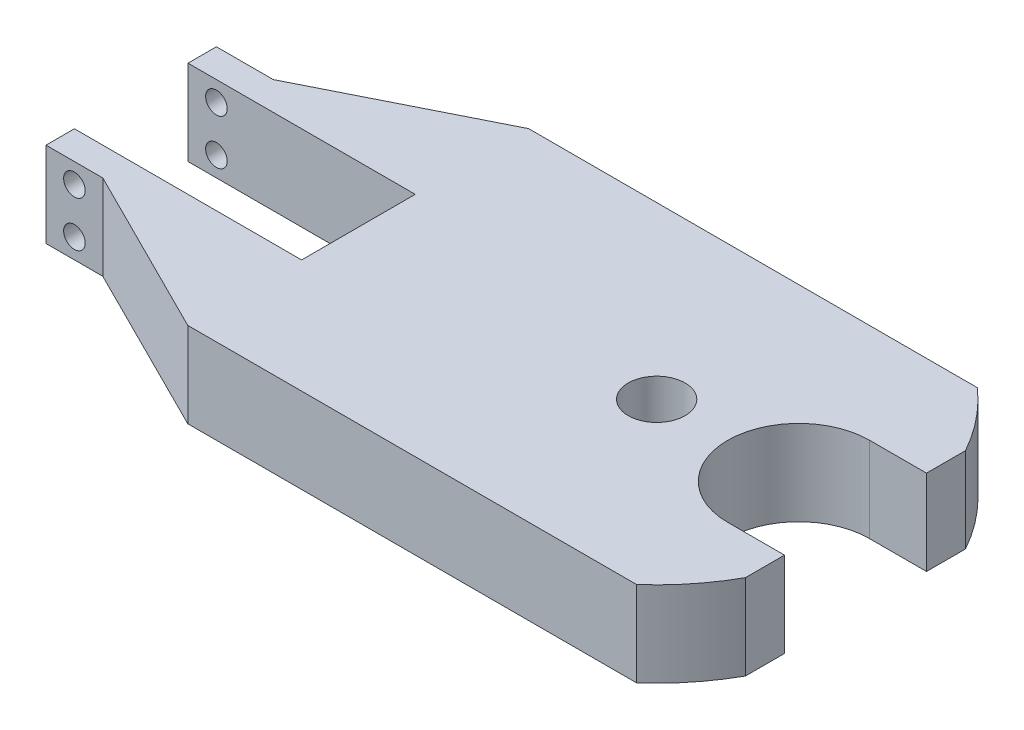
ISO-10303-21;
HEADER;
FILE_DESCRIPTION(('STEP AP214'),'2;1');
FILE_NAME('part.step','',(''),(''),'','','');
FILE_SCHEMA(('AUTOMOTIVE_DESIGN { 1 0 10303 214 1 1 1 1 }'));
ENDSEC;
DATA;
#1=APPLICATION_CONTEXT('core data for automotive mechanical design processes');
#2=APPLICATION_PROTOCOL_DEFINITION('international standard','automotive_design',2000,#1);
#3=PRODUCT_CONTEXT('',#1,'mechanical');
#4=PRODUCT('Part','Part','',(#3));
#5=PRODUCT_RELATED_PRODUCT_CATEGORY('part','',(#4));
#6=PRODUCT_DEFINITION_FORMATION('','',#4);
#7=PRODUCT_DEFINITION_CONTEXT('part definition',#1,'design');
#8=PRODUCT_DEFINITION('design','',#6,#7);
#9=PRODUCT_DEFINITION_SHAPE('','',#8);
#10=(LENGTH_UNIT() NAMED_UNIT(*) SI_UNIT(.MILLI.,.METRE.));
#11=(NAMED_UNIT(*) PLANE_ANGLE_UNIT() SI_UNIT($,.RADIAN.));
#12=(NAMED_UNIT(*) SI_UNIT($,.STERADIAN.) SOLID_ANGLE_UNIT());
#13=UNCERTAINTY_MEASURE_WITH_UNIT(LENGTH_MEASURE(1.E-05),#10,'distance_accuracy_value','');
#14=(GEOMETRIC_REPRESENTATION_CONTEXT(3) GLOBAL_UNCERTAINTY_ASSIGNED_CONTEXT((#13)) GLOBAL_UNIT_ASSIGNED_CONTEXT((#10,
#11,#12)) REPRESENTATION_CONTEXT('',''));
#15=CARTESIAN_POINT('',(0.,0.,0.));
#16=DIRECTION('',(0.,0.,1.));
#17=DIRECTION('',(1.,0.,0.));
#18=AXIS2_PLACEMENT_3D('',#15,#16,#17);
#19=CARTESIAN_POINT('',(5.25,0.75,0.));
#20=DIRECTION('',(0.,-1.,0.));
#21=DIRECTION('',(0.,0.,-1.));
#22=AXIS2_PLACEMENT_3D('',#19,#20,#21);
#23=PLANE('',#22);
#24=DIRECTION('',(0.,0.,1.));
#25=VECTOR('',#24,1.);
#26=CARTESIAN_POINT('',(0.,0.75,-1.));
#27=LINE('',#26,#25);
#28=CARTESIAN_POINT('',(0.,0.75,-1.));
#29=VERTEX_POINT('',#28);
#30=CARTESIAN_POINT('',(0.,0.75,1.));
#31=VERTEX_POINT('',#30);
#32=EDGE_CURVE('E260',#29,#31,#27,.T.);
#33=ORIENTED_EDGE('',*,*,#32,.T.);
#34=DIRECTION('',(-1.,0.,0.));
#35=VECTOR('',#34,1.);
#36=CARTESIAN_POINT('',(0.,0.75,1.));
#37=LINE('',#36,#35);
#38=CARTESIAN_POINT('',(-4.,0.75,1.));
#39=VERTEX_POINT('',#38);
#40=EDGE_CURVE('E136',#31,#39,#37,.T.);
#41=ORIENTED_EDGE('',*,*,#40,.T.);
#42=DIRECTION('',(0.,0.,1.));
#43=VECTOR('',#42,1.);
#44=CARTESIAN_POINT('',(-4.,0.75,1.));
#45=LINE('',#44,#43);
#46=CARTESIAN_POINT('',(-4.,0.75,1.5));
#47=VERTEX_POINT('',#46);
#48=EDGE_CURVE('E364',#39,#47,#45,.T.);
#49=ORIENTED_EDGE('',*,*,#48,.T.);
#50=DIRECTION('',(1.,0.,0.));
#51=VECTOR('',#50,1.);
#52=CARTESIAN_POINT('',(-4.,0.75,1.5));
#53=LINE('',#52,#51);
#54=CARTESIAN_POINT('',(-3.,0.75,1.5));
#55=VERTEX_POINT('',#54);
#56=EDGE_CURVE('E367',#47,#55,#53,.T.);
#57=ORIENTED_EDGE('',*,*,#56,.T.);
#58=DIRECTION('',(0.894153182134338,0.,0.447761194029851));
#59=VECTOR('',#58,1.);
#60=CARTESIAN_POINT('',(-3.,0.75,1.5));
#61=LINE('',#60,#59);
#62=CARTESIAN_POINT('',(-0.00458683984996822,0.75,3.));
#63=VERTEX_POINT('',#62);
#64=EDGE_CURVE('E370',#55,#63,#61,.T.);
#65=ORIENTED_EDGE('',*,*,#64,.T.);
#66=DIRECTION('',(1.,0.,0.));
#67=VECTOR('',#66,1.);
#68=CARTESIAN_POINT('',(-0.00458683984996822,0.75,3.));
#69=LINE('',#68,#67);
#70=CARTESIAN_POINT('',(7.89575131106459,0.75,3.));
#71=VERTEX_POINT('',#70);
#72=EDGE_CURVE('E373',#63,#71,#69,.T.);
#73=ORIENTED_EDGE('',*,*,#72,.T.);
#74=CARTESIAN_POINT('',(5.25,0.75,0.));
#75=DIRECTION('',(0.,1.,0.));
#76=DIRECTION('',(0.,0.,-1.));
#77=AXIS2_PLACEMENT_3D('',#74,#75,#76);
#78=CIRCLE('',#77,4.);
#79=CARTESIAN_POINT('',(8.75,0.75,1.93649167310371));
#80=VERTEX_POINT('',#79);
#81=EDGE_CURVE('E376',#71,#80,#78,.T.);
#82=ORIENTED_EDGE('',*,*,#81,.T.);
#83=DIRECTION('',(0.,0.,-1.));
#84=VECTOR('',#83,1.);
#85=CARTESIAN_POINT('',(8.75,0.75,1.93649167310371));
#86=LINE('',#85,#84);
#87=CARTESIAN_POINT('',(8.75,0.75,1.25));
#88=VERTEX_POINT('',#87);
#89=EDGE_CURVE('E379',#80,#88,#86,.T.);
#90=ORIENTED_EDGE('',*,*,#89,.T.);
#91=DIRECTION('',(-1.,0.,0.));
#92=VECTOR('',#91,1.);
#93=CARTESIAN_POINT('',(8.75,0.75,1.25));
#94=LINE('',#93,#92);
#95=CARTESIAN_POINT('',(7.75,0.75,1.25));
#96=VERTEX_POINT('',#95);
#97=EDGE_CURVE('E382',#88,#96,#94,.T.);
#98=ORIENTED_EDGE('',*,*,#97,.T.);
#99=CARTESIAN_POINT('',(7.75,0.75,0.));
#100=DIRECTION('',(0.,-1.,0.));
#101=DIRECTION('',(0.,0.,1.));
#102=AXIS2_PLACEMENT_3D('',#99,#100,#101);
#103=CIRCLE('',#102,1.25);
#104=CARTESIAN_POINT('',(7.75,0.75,-1.25));
#105=VERTEX_POINT('',#104);
#106=EDGE_CURVE('E385',#96,#105,#103,.T.);
#107=ORIENTED_EDGE('',*,*,#106,.T.);
#108=DIRECTION('',(1.,0.,0.));
#109=VECTOR('',#108,1.);
#110=CARTESIAN_POINT('',(8.75,0.75,-1.25));
#111=LINE('',#110,#109);
#112=CARTESIAN_POINT('',(8.75,0.75,-1.25));
#113=VERTEX_POINT('',#112);
#114=EDGE_CURVE('E388',#105,#113,#111,.T.);
#115=ORIENTED_EDGE('',*,*,#114,.T.);
#116=DIRECTION('',(0.,0.,-1.));
#117=VECTOR('',#116,1.);
#118=CARTESIAN_POINT('',(8.75,0.75,-1.93649167310371));
#119=LINE('',#118,#117);
#120=CARTESIAN_POINT('',(8.75,0.75,-1.93649167310371));
#121=VERTEX_POINT('',#120);
#122=EDGE_CURVE('E391',#113,#121,#119,.T.);
#123=ORIENTED_EDGE('',*,*,#122,.T.);
#124=CARTESIAN_POINT('',(5.25,0.75,0.));
#125=DIRECTION('',(0.,1.,0.));
#126=DIRECTION('',(0.,0.,1.));
#127=AXIS2_PLACEMENT_3D('',#124,#125,#126);
#128=CIRCLE('',#127,4.);
#129=CARTESIAN_POINT('',(7.89575131106459,0.75,-3.));
#130=VERTEX_POINT('',#129);
#131=EDGE_CURVE('E394',#121,#130,#128,.T.);
#132=ORIENTED_EDGE('',*,*,#131,.T.);
#133=DIRECTION('',(-1.,0.,0.));
#134=VECTOR('',#133,1.);
#135=CARTESIAN_POINT('',(-0.00458683984996822,0.75,-3.));
#136=LINE('',#135,#134);
#137=CARTESIAN_POINT('',(-0.00458683984996822,0.75,-3.));
#138=VERTEX_POINT('',#137);
#139=EDGE_CURVE('E397',#130,#138,#136,.T.);
#140=ORIENTED_EDGE('',*,*,#139,.T.);
#141=DIRECTION('',(-0.894153182134338,0.,0.447761194029851));
#142=VECTOR('',#141,1.);
#143=CARTESIAN_POINT('',(-3.,0.75,-1.5));
#144=LINE('',#143,#142);
#145=CARTESIAN_POINT('',(-3.,0.75,-1.5));
#146=VERTEX_POINT('',#145);
#147=EDGE_CURVE('E185',#138,#146,#144,.T.);
#148=ORIENTED_EDGE('',*,*,#147,.T.);
#149=DIRECTION('',(-1.,0.,0.));
#150=VECTOR('',#149,1.);
#151=CARTESIAN_POINT('',(-4.,0.75,-1.5));
#152=LINE('',#151,#150);
#153=CARTESIAN_POINT('',(-4.,0.75,-1.5));
#154=VERTEX_POINT('',#153);
#155=EDGE_CURVE('E179',#146,#154,#152,.T.);
#156=ORIENTED_EDGE('',*,*,#155,.T.);
#157=DIRECTION('',(0.,0.,1.));
#158=VECTOR('',#157,1.);
#159=CARTESIAN_POINT('',(-4.,0.75,-1.));
#160=LINE('',#159,#158);
#161=CARTESIAN_POINT('',(-4.,0.75,-1.));
#162=VERTEX_POINT('',#161);
#163=EDGE_CURVE('E183',#154,#162,#160,.T.);
#164=ORIENTED_EDGE('',*,*,#163,.T.);
#165=DIRECTION('',(1.,0.,0.));
#166=VECTOR('',#165,1.);
#167=CARTESIAN_POINT('',(0.,0.75,-1.));
#168=LINE('',#167,#166);
#169=EDGE_CURVE('E63',#162,#29,#168,.T.);
#170=ORIENTED_EDGE('',*,*,#169,.T.);
#171=EDGE_LOOP('',(#33,#41,#49,#57,#65,#73,#82,#90,#98,#107,#115,#123,#132,#140,#148,#156,#164,#170));
#172=FACE_BOUND('',#171,.T.);
#173=CARTESIAN_POINT('',(5.25,0.75,0.));
#174=DIRECTION('',(0.,1.,0.));
#175=DIRECTION('',(0.,0.,1.));
#176=AXIS2_PLACEMENT_3D('',#173,#174,#175);
#177=CIRCLE('',#176,0.500000000000001);
#178=CARTESIAN_POINT('',(5.25,0.75,0.500000000000001));
#179=VERTEX_POINT('',#178);
#180=EDGE_CURVE('E212',#179,#179,#177,.T.);
#181=ORIENTED_EDGE('',*,*,#180,.F.);
#182=EDGE_LOOP('',(#181));
#183=FACE_BOUND('',#182,.T.);
#184=ADVANCED_FACE('F43',(#172,#183),#23,.F.);
#185=CARTESIAN_POINT('',(5.25,-0.75,0.));
#186=DIRECTION('',(0.,-1.,0.));
#187=DIRECTION('',(0.,0.,-1.));
#188=AXIS2_PLACEMENT_3D('',#185,#186,#187);
#189=PLANE('',#188);
#190=DIRECTION('',(0.,0.,1.));
#191=VECTOR('',#190,1.);
#192=CARTESIAN_POINT('',(0.,-0.75,-1.));
#193=LINE('',#192,#191);
#194=CARTESIAN_POINT('',(0.,-0.75,-1.));
#195=VERTEX_POINT('',#194);
#196=CARTESIAN_POINT('',(0.,-0.75,1.));
#197=VERTEX_POINT('',#196);
#198=EDGE_CURVE('E207',#195,#197,#193,.T.);
#199=ORIENTED_EDGE('',*,*,#198,.F.);
#200=DIRECTION('',(1.,0.,0.));
#201=VECTOR('',#200,1.);
#202=CARTESIAN_POINT('',(0.,-0.75,-1.));
#203=LINE('',#202,#201);
#204=CARTESIAN_POINT('',(-4.,-0.75,-1.));
#205=VERTEX_POINT('',#204);
#206=EDGE_CURVE('E128',#205,#195,#203,.T.);
#207=ORIENTED_EDGE('',*,*,#206,.F.);
#208=DIRECTION('',(0.,0.,1.));
#209=VECTOR('',#208,1.);
#210=CARTESIAN_POINT('',(-4.,-0.75,-1.));
#211=LINE('',#210,#209);
#212=CARTESIAN_POINT('',(-4.,-0.75,-1.5));
#213=VERTEX_POINT('',#212);
#214=EDGE_CURVE('E122',#213,#205,#211,.T.);
#215=ORIENTED_EDGE('',*,*,#214,.F.);
#216=DIRECTION('',(-1.,0.,0.));
#217=VECTOR('',#216,1.);
#218=CARTESIAN_POINT('',(-4.,-0.75,-1.5));
#219=LINE('',#218,#217);
#220=CARTESIAN_POINT('',(-3.,-0.75,-1.5));
#221=VERTEX_POINT('',#220);
#222=EDGE_CURVE('E194',#221,#213,#219,.T.);
#223=ORIENTED_EDGE('',*,*,#222,.F.);
#224=DIRECTION('',(-0.894153182134338,0.,0.447761194029851));
#225=VECTOR('',#224,1.);
#226=CARTESIAN_POINT('',(-3.,-0.75,-1.5));
#227=LINE('',#226,#225);
#228=CARTESIAN_POINT('',(-0.00458683984996822,-0.75,-3.));
#229=VERTEX_POINT('',#228);
#230=EDGE_CURVE('E251',#229,#221,#227,.T.);
#231=ORIENTED_EDGE('',*,*,#230,.F.);
#232=DIRECTION('',(-1.,0.,0.));
#233=VECTOR('',#232,1.);
#234=CARTESIAN_POINT('',(-0.00458683984996822,-0.75,-3.));
#235=LINE('',#234,#233);
#236=CARTESIAN_POINT('',(7.89575131106459,-0.75,-3.));
#237=VERTEX_POINT('',#236);
#238=EDGE_CURVE('E248',#237,#229,#235,.T.);
#239=ORIENTED_EDGE('',*,*,#238,.F.);
#240=CARTESIAN_POINT('',(5.25,-0.75,0.));
#241=DIRECTION('',(0.,1.,0.));
#242=DIRECTION('',(0.,0.,1.));
#243=AXIS2_PLACEMENT_3D('',#240,#241,#242);
#244=CIRCLE('',#243,4.);
#245=CARTESIAN_POINT('',(8.75,-0.75,-1.93649167310371));
#246=VERTEX_POINT('',#245);
#247=EDGE_CURVE('E245',#246,#237,#244,.T.);
#248=ORIENTED_EDGE('',*,*,#247,.F.);
#249=DIRECTION('',(0.,0.,-1.));
#250=VECTOR('',#249,1.);
#251=CARTESIAN_POINT('',(8.75,-0.75,-1.93649167310371));
#252=LINE('',#251,#250);
#253=CARTESIAN_POINT('',(8.75,-0.75,-1.25));
#254=VERTEX_POINT('',#253);
#255=EDGE_CURVE('E242',#254,#246,#252,.T.);
#256=ORIENTED_EDGE('',*,*,#255,.F.);
#257=DIRECTION('',(1.,0.,0.));
#258=VECTOR('',#257,1.);
#259=CARTESIAN_POINT('',(8.75,-0.75,-1.25));
#260=LINE('',#259,#258);
#261=CARTESIAN_POINT('',(7.75,-0.75,-1.25));
#262=VERTEX_POINT('',#261);
#263=EDGE_CURVE('E239',#262,#254,#260,.T.);
#264=ORIENTED_EDGE('',*,*,#263,.F.);
#265=CARTESIAN_POINT('',(7.75,-0.75,0.));
#266=DIRECTION('',(0.,-1.,0.));
#267=DIRECTION('',(0.,0.,1.));
#268=AXIS2_PLACEMENT_3D('',#265,#266,#267);
#269=CIRCLE('',#268,1.25);
#270=CARTESIAN_POINT('',(7.75,-0.75,1.25));
#271=VERTEX_POINT('',#270);
#272=EDGE_CURVE('E236',#271,#262,#269,.T.);
#273=ORIENTED_EDGE('',*,*,#272,.F.);
#274=DIRECTION('',(-1.,0.,0.));
#275=VECTOR('',#274,1.);
#276=CARTESIAN_POINT('',(8.75,-0.75,1.25));
#277=LINE('',#276,#275);
#278=CARTESIAN_POINT('',(8.75,-0.75,1.25));
#279=VERTEX_POINT('',#278);
#280=EDGE_CURVE('E233',#279,#271,#277,.T.);
#281=ORIENTED_EDGE('',*,*,#280,.F.);
#282=DIRECTION('',(0.,0.,-1.));
#283=VECTOR('',#282,1.);
#284=CARTESIAN_POINT('',(8.75,-0.75,1.93649167310371));
#285=LINE('',#284,#283);
#286=CARTESIAN_POINT('',(8.75,-0.75,1.93649167310371));
#287=VERTEX_POINT('',#286);
#288=EDGE_CURVE('E230',#287,#279,#285,.T.);
#289=ORIENTED_EDGE('',*,*,#288,.F.);
#290=CARTESIAN_POINT('',(5.25,-0.75,0.));
#291=DIRECTION('',(0.,1.,0.));
#292=DIRECTION('',(0.,0.,-1.));
#293=AXIS2_PLACEMENT_3D('',#290,#291,#292);
#294=CIRCLE('',#293,4.);
#295=CARTESIAN_POINT('',(7.89575131106459,-0.75,3.));
#296=VERTEX_POINT('',#295);
#297=EDGE_CURVE('E227',#296,#287,#294,.T.);
#298=ORIENTED_EDGE('',*,*,#297,.F.);
#299=DIRECTION('',(1.,0.,0.));
#300=VECTOR('',#299,1.);
#301=CARTESIAN_POINT('',(-0.00458683984996822,-0.75,3.));
#302=LINE('',#301,#300);
#303=CARTESIAN_POINT('',(-0.00458683984996822,-0.75,3.));
#304=VERTEX_POINT('',#303);
#305=EDGE_CURVE('E224',#304,#296,#302,.T.);
#306=ORIENTED_EDGE('',*,*,#305,.F.);
#307=DIRECTION('',(0.894153182134338,0.,0.447761194029851));
#308=VECTOR('',#307,1.);
#309=CARTESIAN_POINT('',(-3.,-0.75,1.5));
#310=LINE('',#309,#308);
#311=CARTESIAN_POINT('',(-3.,-0.75,1.5));
#312=VERTEX_POINT('',#311);
#313=EDGE_CURVE('E221',#312,#304,#310,.T.);
#314=ORIENTED_EDGE('',*,*,#313,.F.);
#315=DIRECTION('',(1.,0.,0.));
#316=VECTOR('',#315,1.);
#317=CARTESIAN_POINT('',(-4.,-0.75,1.5));
#318=LINE('',#317,#316);
#319=CARTESIAN_POINT('',(-4.,-0.75,1.5));
#320=VERTEX_POINT('',#319);
#321=EDGE_CURVE('E218',#320,#312,#318,.T.);
#322=ORIENTED_EDGE('',*,*,#321,.F.);
#323=DIRECTION('',(0.,0.,1.));
#324=VECTOR('',#323,1.);
#325=CARTESIAN_POINT('',(-4.,-0.75,1.));
#326=LINE('',#325,#324);
#327=CARTESIAN_POINT('',(-4.,-0.75,1.));
#328=VERTEX_POINT('',#327);
#329=EDGE_CURVE('E215',#328,#320,#326,.T.);
#330=ORIENTED_EDGE('',*,*,#329,.F.);
#331=DIRECTION('',(-1.,0.,0.));
#332=VECTOR('',#331,1.);
#333=CARTESIAN_POINT('',(0.,-0.75,1.));
#334=LINE('',#333,#332);
#335=EDGE_CURVE('E211',#197,#328,#334,.T.);
#336=ORIENTED_EDGE('',*,*,#335,.F.);
#337=EDGE_LOOP('',(#199,#207,#215,#223,#231,#239,#248,#256,#264,#273,#281,#289,#298,#306,#314,
#322,#330,#336));
#338=FACE_BOUND('',#337,.T.);
#339=CARTESIAN_POINT('',(5.25,-0.75,0.));
#340=DIRECTION('',(0.,1.,0.));
#341=DIRECTION('',(0.,0.,1.));
#342=AXIS2_PLACEMENT_3D('',#339,#340,#341);
#343=CIRCLE('',#342,0.500000000000001);
#344=CARTESIAN_POINT('',(5.25,-0.75,0.500000000000001));
#345=VERTEX_POINT('',#344);
#346=EDGE_CURVE('E353',#345,#345,#343,.T.);
#347=ORIENTED_EDGE('',*,*,#346,.T.);
#348=EDGE_LOOP('',(#347));
#349=FACE_BOUND('',#348,.T.);
#350=ADVANCED_FACE('F433',(#338,#349),#189,.T.);
#351=CARTESIAN_POINT('',(0.,0.75,-1.));
#352=DIRECTION('',(1.,0.,0.));
#353=DIRECTION('',(0.,0.,-1.));
#354=AXIS2_PLACEMENT_3D('',#351,#352,#353);
#355=PLANE('',#354);
#356=CARTESIAN_POINT('',(0.,0.,0.));
#357=DIRECTION('',(-1.,0.,0.));
#358=DIRECTION('',(0.,0.,1.));
#359=AXIS2_PLACEMENT_3D('',#356,#357,#358);
#360=CIRCLE('',#359,0.375);
#361=CARTESIAN_POINT('',(0.,0.,0.375));
#362=VERTEX_POINT('',#361);
#363=EDGE_CURVE('E339',#362,#362,#360,.T.);
#364=ORIENTED_EDGE('',*,*,#363,.F.);
#365=EDGE_LOOP('',(#364));
#366=FACE_BOUND('',#365,.T.);
#367=ORIENTED_EDGE('',*,*,#198,.T.);
#368=DIRECTION('',(0.,-1.,0.));
#369=VECTOR('',#368,1.);
#370=CARTESIAN_POINT('',(0.,0.75,1.));
#371=LINE('',#370,#369);
#372=EDGE_CURVE('E11',#31,#197,#371,.T.);
#373=ORIENTED_EDGE('',*,*,#372,.F.);
#374=ORIENTED_EDGE('',*,*,#32,.F.);
#375=DIRECTION('',(0.,-1.,0.));
#376=VECTOR('',#375,1.);
#377=CARTESIAN_POINT('',(0.,0.75,-1.));
#378=LINE('',#377,#376);
#379=EDGE_CURVE('E203',#29,#195,#378,.T.);
#380=ORIENTED_EDGE('',*,*,#379,.T.);
#381=EDGE_LOOP('',(#367,#373,#374,#380));
#382=FACE_BOUND('',#381,.T.);
#383=ADVANCED_FACE('F45',(#366,#382),#355,.F.);
#384=CARTESIAN_POINT('',(0.,0.75,1.));
#385=DIRECTION('',(0.,0.,1.));
#386=DIRECTION('',(1.,0.,0.));
#387=AXIS2_PLACEMENT_3D('',#384,#385,#386);
#388=PLANE('',#387);
#389=CARTESIAN_POINT('',(-3.5,0.4,1.));
#390=DIRECTION('',(0.,0.,1.));
#391=DIRECTION('',(1.,0.,0.));
#392=AXIS2_PLACEMENT_3D('',#389,#390,#391);
#393=CIRCLE('',#392,0.19);
#394=CARTESIAN_POINT('',(-3.31,0.4,1.));
#395=VERTEX_POINT('',#394);
#396=EDGE_CURVE('E349',#395,#395,#393,.T.);
#397=ORIENTED_EDGE('',*,*,#396,.T.);
#398=EDGE_LOOP('',(#397));
#399=FACE_BOUND('',#398,.T.);
#400=CARTESIAN_POINT('',(-3.5,-0.4,1.));
#401=DIRECTION('',(0.,0.,1.));
#402=DIRECTION('',(1.,0.,0.));
#403=AXIS2_PLACEMENT_3D('',#400,#401,#402);
#404=CIRCLE('',#403,0.19);
#405=CARTESIAN_POINT('',(-3.31,-0.4,1.));
#406=VERTEX_POINT('',#405);
#407=EDGE_CURVE('E327',#406,#406,#404,.T.);
#408=ORIENTED_EDGE('',*,*,#407,.T.);
#409=EDGE_LOOP('',(#408));
#410=FACE_BOUND('',#409,.T.);
#411=ORIENTED_EDGE('',*,*,#335,.T.);
#412=DIRECTION('',(0.,-1.,0.));
#413=VECTOR('',#412,1.);
#414=CARTESIAN_POINT('',(-4.,0.75,1.));
#415=LINE('',#414,#413);
#416=EDGE_CURVE('E54',#39,#328,#415,.T.);
#417=ORIENTED_EDGE('',*,*,#416,.F.);
#418=ORIENTED_EDGE('',*,*,#40,.F.);
#419=ORIENTED_EDGE('',*,*,#372,.T.);
#420=EDGE_LOOP('',(#411,#417,#418,#419));
#421=FACE_BOUND('',#420,.T.);
#422=ADVANCED_FACE('F494',(#399,#410,#421),#388,.F.);
#423=CARTESIAN_POINT('',(-4.,0.75,1.));
#424=DIRECTION('',(1.,0.,0.));
#425=DIRECTION('',(0.,0.,-1.));
#426=AXIS2_PLACEMENT_3D('',#423,#424,#425);
#427=PLANE('',#426);
#428=ORIENTED_EDGE('',*,*,#329,.T.);
#429=DIRECTION('',(0.,-1.,0.));
#430=VECTOR('',#429,1.);
#431=CARTESIAN_POINT('',(-4.,0.75,1.5));
#432=LINE('',#431,#430);
#433=EDGE_CURVE('E311',#47,#320,#432,.T.);
#434=ORIENTED_EDGE('',*,*,#433,.F.);
#435=ORIENTED_EDGE('',*,*,#48,.F.);
#436=ORIENTED_EDGE('',*,*,#416,.T.);
#437=EDGE_LOOP('',(#428,#434,#435,#436));
#438=FACE_BOUND('',#437,.T.);
#439=ADVANCED_FACE('F491',(#438),#427,.F.);
#440=CARTESIAN_POINT('',(-4.,0.75,1.5));
#441=DIRECTION('',(0.,0.,-1.));
#442=DIRECTION('',(-1.,0.,0.));
#443=AXIS2_PLACEMENT_3D('',#440,#441,#442);
#444=PLANE('',#443);
#445=CARTESIAN_POINT('',(-3.5,0.4,1.5));
#446=DIRECTION('',(0.,0.,1.));
#447=DIRECTION('',(1.,0.,0.));
#448=AXIS2_PLACEMENT_3D('',#445,#446,#447);
#449=CIRCLE('',#448,0.19);
#450=CARTESIAN_POINT('',(-3.31,0.4,1.5));
#451=VERTEX_POINT('',#450);
#452=EDGE_CURVE('E321',#451,#451,#449,.T.);
#453=ORIENTED_EDGE('',*,*,#452,.F.);
#454=EDGE_LOOP('',(#453));
#455=FACE_BOUND('',#454,.T.);
#456=CARTESIAN_POINT('',(-3.5,-0.4,1.5));
#457=DIRECTION('',(0.,0.,1.));
#458=DIRECTION('',(1.,0.,0.));
#459=AXIS2_PLACEMENT_3D('',#456,#457,#458);
#460=CIRCLE('',#459,0.19);
#461=CARTESIAN_POINT('',(-3.31,-0.4,1.5));
#462=VERTEX_POINT('',#461);
#463=EDGE_CURVE('E330',#462,#462,#460,.T.);
#464=ORIENTED_EDGE('',*,*,#463,.F.);
#465=EDGE_LOOP('',(#464));
#466=FACE_BOUND('',#465,.T.);
#467=ORIENTED_EDGE('',*,*,#321,.T.);
#468=DIRECTION('',(0.,-1.,0.));
#469=VECTOR('',#468,1.);
#470=CARTESIAN_POINT('',(-3.,0.75,1.5));
#471=LINE('',#470,#469);
#472=EDGE_CURVE('E307',#55,#312,#471,.T.);
#473=ORIENTED_EDGE('',*,*,#472,.F.);
#474=ORIENTED_EDGE('',*,*,#56,.F.);
#475=ORIENTED_EDGE('',*,*,#433,.T.);
#476=EDGE_LOOP('',(#467,#473,#474,#475));
#477=FACE_BOUND('',#476,.T.);
#478=ADVANCED_FACE('F487',(#455,#466,#477),#444,.F.);
#479=CARTESIAN_POINT('',(-3.,0.75,1.5));
#480=DIRECTION('',(0.447761194029851,0.,-0.894153182134338));
#481=DIRECTION('',(-0.894153182134338,0.,-0.447761194029851));
#482=AXIS2_PLACEMENT_3D('',#479,#480,#481);
#483=PLANE('',#482);
#484=ORIENTED_EDGE('',*,*,#313,.T.);
#485=DIRECTION('',(0.,-1.,0.));
#486=VECTOR('',#485,1.);
#487=CARTESIAN_POINT('',(-0.00458683984996822,0.75,3.));
#488=LINE('',#487,#486);
#489=EDGE_CURVE('E303',#63,#304,#488,.T.);
#490=ORIENTED_EDGE('',*,*,#489,.F.);
#491=ORIENTED_EDGE('',*,*,#64,.F.);
#492=ORIENTED_EDGE('',*,*,#472,.T.);
#493=EDGE_LOOP('',(#484,#490,#491,#492));
#494=FACE_BOUND('',#493,.T.);
#495=ADVANCED_FACE('F483',(#494),#483,.F.);
#496=CARTESIAN_POINT('',(-0.00458683984996822,0.75,3.));
#497=DIRECTION('',(0.,0.,-1.));
#498=DIRECTION('',(-1.,0.,0.));
#499=AXIS2_PLACEMENT_3D('',#496,#497,#498);
#500=PLANE('',#499);
#501=ORIENTED_EDGE('',*,*,#305,.T.);
#502=DIRECTION('',(0.,-1.,0.));
#503=VECTOR('',#502,1.);
#504=CARTESIAN_POINT('',(7.89575131106459,0.75,3.));
#505=LINE('',#504,#503);
#506=EDGE_CURVE('E299',#71,#296,#505,.T.);
#507=ORIENTED_EDGE('',*,*,#506,.F.);
#508=ORIENTED_EDGE('',*,*,#72,.F.);
#509=ORIENTED_EDGE('',*,*,#489,.T.);
#510=EDGE_LOOP('',(#501,#507,#508,#509));
#511=FACE_BOUND('',#510,.T.);
#512=ADVANCED_FACE('F479',(#511),#500,.F.);
#513=CARTESIAN_POINT('',(5.25,0.75,0.));
#514=DIRECTION('',(0.,-1.,0.));
#515=DIRECTION('',(0.,0.,-1.));
#516=AXIS2_PLACEMENT_3D('',#513,#514,#515);
#517=CYLINDRICAL_SURFACE('',#516,4.);
#518=ORIENTED_EDGE('',*,*,#297,.T.);
#519=DIRECTION('',(0.,-1.,0.));
#520=VECTOR('',#519,1.);
#521=CARTESIAN_POINT('',(8.75,0.75,1.93649167310371));
#522=LINE('',#521,#520);
#523=EDGE_CURVE('E295',#80,#287,#522,.T.);
#524=ORIENTED_EDGE('',*,*,#523,.F.);
#525=ORIENTED_EDGE('',*,*,#81,.F.);
#526=ORIENTED_EDGE('',*,*,#506,.T.);
#527=EDGE_LOOP('',(#518,#524,#525,#526));
#528=FACE_BOUND('',#527,.T.);
#529=ADVANCED_FACE('F475',(#528),#517,.T.);
#530=CARTESIAN_POINT('',(8.75,0.75,1.93649167310371));
#531=DIRECTION('',(-1.,0.,0.));
#532=DIRECTION('',(0.,0.,1.));
#533=AXIS2_PLACEMENT_3D('',#530,#531,#532);
#534=PLANE('',#533);
#535=ORIENTED_EDGE('',*,*,#288,.T.);
#536=DIRECTION('',(0.,-1.,0.));
#537=VECTOR('',#536,1.);
#538=CARTESIAN_POINT('',(8.75,0.75,1.25));
#539=LINE('',#538,#537);
#540=EDGE_CURVE('E291',#88,#279,#539,.T.);
#541=ORIENTED_EDGE('',*,*,#540,.F.);
#542=ORIENTED_EDGE('',*,*,#89,.F.);
#543=ORIENTED_EDGE('',*,*,#523,.T.);
#544=EDGE_LOOP('',(#535,#541,#542,#543));
#545=FACE_BOUND('',#544,.T.);
#546=ADVANCED_FACE('F471',(#545),#534,.F.);
#547=CARTESIAN_POINT('',(8.75,0.75,1.25));
#548=DIRECTION('',(0.,0.,1.));
#549=DIRECTION('',(1.,0.,0.));
#550=AXIS2_PLACEMENT_3D('',#547,#548,#549);
#551=PLANE('',#550);
#552=ORIENTED_EDGE('',*,*,#280,.T.);
#553=DIRECTION('',(0.,-1.,0.));
#554=VECTOR('',#553,1.);
#555=CARTESIAN_POINT('',(7.75,0.75,1.25));
#556=LINE('',#555,#554);
#557=EDGE_CURVE('E287',#96,#271,#556,.T.);
#558=ORIENTED_EDGE('',*,*,#557,.F.);
#559=ORIENTED_EDGE('',*,*,#97,.F.);
#560=ORIENTED_EDGE('',*,*,#540,.T.);
#561=EDGE_LOOP('',(#552,#558,#559,#560));
#562=FACE_BOUND('',#561,.T.);
#563=ADVANCED_FACE('F467',(#562),#551,.F.);
#564=CARTESIAN_POINT('',(7.75,0.75,0.));
#565=DIRECTION('',(0.,-1.,0.));
#566=DIRECTION('',(0.,0.,-1.));
#567=AXIS2_PLACEMENT_3D('',#564,#565,#566);
#568=CYLINDRICAL_SURFACE('',#567,1.25);
#569=ORIENTED_EDGE('',*,*,#272,.T.);
#570=DIRECTION('',(0.,-1.,0.));
#571=VECTOR('',#570,1.);
#572=CARTESIAN_POINT('',(7.75,0.75,-1.25));
#573=LINE('',#572,#571);
#574=EDGE_CURVE('E283',#105,#262,#573,.T.);
#575=ORIENTED_EDGE('',*,*,#574,.F.);
#576=ORIENTED_EDGE('',*,*,#106,.F.);
#577=ORIENTED_EDGE('',*,*,#557,.T.);
#578=EDGE_LOOP('',(#569,#575,#576,#577));
#579=FACE_BOUND('',#578,.T.);
#580=ADVANCED_FACE('F463',(#579),#568,.F.);
#581=CARTESIAN_POINT('',(8.75,0.75,-1.25));
#582=DIRECTION('',(0.,0.,-1.));
#583=DIRECTION('',(-1.,0.,0.));
#584=AXIS2_PLACEMENT_3D('',#581,#582,#583);
#585=PLANE('',#584);
#586=ORIENTED_EDGE('',*,*,#263,.T.);
#587=DIRECTION('',(0.,-1.,0.));
#588=VECTOR('',#587,1.);
#589=CARTESIAN_POINT('',(8.75,0.75,-1.25));
#590=LINE('',#589,#588);
#591=EDGE_CURVE('E279',#113,#254,#590,.T.);
#592=ORIENTED_EDGE('',*,*,#591,.F.);
#593=ORIENTED_EDGE('',*,*,#114,.F.);
#594=ORIENTED_EDGE('',*,*,#574,.T.);
#595=EDGE_LOOP('',(#586,#592,#593,#594));
#596=FACE_BOUND('',#595,.T.);
#597=ADVANCED_FACE('F459',(#596),#585,.F.);
#598=CARTESIAN_POINT('',(8.75,0.75,-1.93649167310371));
#599=DIRECTION('',(-1.,0.,0.));
#600=DIRECTION('',(0.,0.,1.));
#601=AXIS2_PLACEMENT_3D('',#598,#599,#600);
#602=PLANE('',#601);
#603=ORIENTED_EDGE('',*,*,#255,.T.);
#604=DIRECTION('',(0.,-1.,0.));
#605=VECTOR('',#604,1.);
#606=CARTESIAN_POINT('',(8.75,0.75,-1.93649167310371));
#607=LINE('',#606,#605);
#608=EDGE_CURVE('E275',#121,#246,#607,.T.);
#609=ORIENTED_EDGE('',*,*,#608,.F.);
#610=ORIENTED_EDGE('',*,*,#122,.F.);
#611=ORIENTED_EDGE('',*,*,#591,.T.);
#612=EDGE_LOOP('',(#603,#609,#610,#611));
#613=FACE_BOUND('',#612,.T.);
#614=ADVANCED_FACE('F455',(#613),#602,.F.);
#615=CARTESIAN_POINT('',(5.25,0.75,0.));
#616=DIRECTION('',(0.,-1.,0.));
#617=DIRECTION('',(0.,0.,-1.));
#618=AXIS2_PLACEMENT_3D('',#615,#616,#617);
#619=CYLINDRICAL_SURFACE('',#618,4.);
#620=ORIENTED_EDGE('',*,*,#247,.T.);
#621=DIRECTION('',(0.,-1.,0.));
#622=VECTOR('',#621,1.);
#623=CARTESIAN_POINT('',(7.89575131106459,0.75,-3.));
#624=LINE('',#623,#622);
#625=EDGE_CURVE('E271',#130,#237,#624,.T.);
#626=ORIENTED_EDGE('',*,*,#625,.F.);
#627=ORIENTED_EDGE('',*,*,#131,.F.);
#628=ORIENTED_EDGE('',*,*,#608,.T.);
#629=EDGE_LOOP('',(#620,#626,#627,#628));
#630=FACE_BOUND('',#629,.T.);
#631=ADVANCED_FACE('F451',(#630),#619,.T.);
#632=CARTESIAN_POINT('',(-0.00458683984996822,0.75,-3.));
#633=DIRECTION('',(0.,0.,1.));
#634=DIRECTION('',(1.,0.,0.));
#635=AXIS2_PLACEMENT_3D('',#632,#633,#634);
#636=PLANE('',#635);
#637=ORIENTED_EDGE('',*,*,#238,.T.);
#638=DIRECTION('',(0.,-1.,0.));
#639=VECTOR('',#638,1.);
#640=CARTESIAN_POINT('',(-0.00458683984996822,0.75,-3.));
#641=LINE('',#640,#639);
#642=EDGE_CURVE('E267',#138,#229,#641,.T.);
#643=ORIENTED_EDGE('',*,*,#642,.F.);
#644=ORIENTED_EDGE('',*,*,#139,.F.);
#645=ORIENTED_EDGE('',*,*,#625,.T.);
#646=EDGE_LOOP('',(#637,#643,#644,#645));
#647=FACE_BOUND('',#646,.T.);
#648=ADVANCED_FACE('F447',(#647),#636,.F.);
#649=CARTESIAN_POINT('',(-3.,0.75,-1.5));
#650=DIRECTION('',(0.447761194029851,0.,0.894153182134338));
#651=DIRECTION('',(0.894153182134338,0.,-0.447761194029851));
#652=AXIS2_PLACEMENT_3D('',#649,#650,#651);
#653=PLANE('',#652);
#654=ORIENTED_EDGE('',*,*,#230,.T.);
#655=DIRECTION('',(0.,-1.,0.));
#656=VECTOR('',#655,1.);
#657=CARTESIAN_POINT('',(-3.,0.75,-1.5));
#658=LINE('',#657,#656);
#659=EDGE_CURVE('E196',#146,#221,#658,.T.);
#660=ORIENTED_EDGE('',*,*,#659,.F.);
#661=ORIENTED_EDGE('',*,*,#147,.F.);
#662=ORIENTED_EDGE('',*,*,#642,.T.);
#663=EDGE_LOOP('',(#654,#660,#661,#662));
#664=FACE_BOUND('',#663,.T.);
#665=ADVANCED_FACE('F417',(#664),#653,.F.);
#666=CARTESIAN_POINT('',(-4.,0.75,-1.5));
#667=DIRECTION('',(0.,0.,1.));
#668=DIRECTION('',(1.,0.,0.));
#669=AXIS2_PLACEMENT_3D('',#666,#667,#668);
#670=PLANE('',#669);
#671=CARTESIAN_POINT('',(-3.5,0.4,-1.5));
#672=DIRECTION('',(0.,0.,1.));
#673=DIRECTION('',(1.,0.,0.));
#674=AXIS2_PLACEMENT_3D('',#671,#672,#673);
#675=CIRCLE('',#674,0.19);
#676=CARTESIAN_POINT('',(-3.31,0.4,-1.5));
#677=VERTEX_POINT('',#676);
#678=EDGE_CURVE('E345',#677,#677,#675,.T.);
#679=ORIENTED_EDGE('',*,*,#678,.T.);
#680=EDGE_LOOP('',(#679));
#681=FACE_BOUND('',#680,.T.);
#682=CARTESIAN_POINT('',(-3.5,-0.4,-1.5));
#683=DIRECTION('',(0.,0.,1.));
#684=DIRECTION('',(1.,0.,0.));
#685=AXIS2_PLACEMENT_3D('',#682,#683,#684);
#686=CIRCLE('',#685,0.19);
#687=CARTESIAN_POINT('',(-3.31,-0.4,-1.5));
#688=VERTEX_POINT('',#687);
#689=EDGE_CURVE('E320',#688,#688,#686,.T.);
#690=ORIENTED_EDGE('',*,*,#689,.T.);
#691=EDGE_LOOP('',(#690));
#692=FACE_BOUND('',#691,.T.);
#693=ORIENTED_EDGE('',*,*,#222,.T.);
#694=DIRECTION('',(0.,-1.,0.));
#695=VECTOR('',#694,1.);
#696=CARTESIAN_POINT('',(-4.,0.75,-1.5));
#697=LINE('',#696,#695);
#698=EDGE_CURVE('E191',#154,#213,#697,.T.);
#699=ORIENTED_EDGE('',*,*,#698,.F.);
#700=ORIENTED_EDGE('',*,*,#155,.F.);
#701=ORIENTED_EDGE('',*,*,#659,.T.);
#702=EDGE_LOOP('',(#693,#699,#700,#701));
#703=FACE_BOUND('',#702,.T.);
#704=ADVANCED_FACE('F192',(#681,#692,#703),#670,.F.);
#705=CARTESIAN_POINT('',(-4.,0.75,-1.));
#706=DIRECTION('',(1.,0.,0.));
#707=DIRECTION('',(0.,0.,-1.));
#708=AXIS2_PLACEMENT_3D('',#705,#706,#707);
#709=PLANE('',#708);
#710=ORIENTED_EDGE('',*,*,#214,.T.);
#711=DIRECTION('',(0.,-1.,0.));
#712=VECTOR('',#711,1.);
#713=CARTESIAN_POINT('',(-4.,0.75,-1.));
#714=LINE('',#713,#712);
#715=EDGE_CURVE('E197',#162,#205,#714,.T.);
#716=ORIENTED_EDGE('',*,*,#715,.F.);
#717=ORIENTED_EDGE('',*,*,#163,.F.);
#718=ORIENTED_EDGE('',*,*,#698,.T.);
#719=EDGE_LOOP('',(#710,#716,#717,#718));
#720=FACE_BOUND('',#719,.T.);
#721=ADVANCED_FACE('F199',(#720),#709,.F.);
#722=CARTESIAN_POINT('',(0.,0.75,-1.));
#723=DIRECTION('',(0.,0.,-1.));
#724=DIRECTION('',(-1.,0.,0.));
#725=AXIS2_PLACEMENT_3D('',#722,#723,#724);
#726=PLANE('',#725);
#727=CARTESIAN_POINT('',(-3.5,0.4,-1.));
#728=DIRECTION('',(0.,0.,-1.));
#729=DIRECTION('',(-1.,0.,0.));
#730=AXIS2_PLACEMENT_3D('',#727,#728,#729);
#731=CIRCLE('',#730,0.19);
#732=CARTESIAN_POINT('',(-3.69,0.4,-1.));
#733=VERTEX_POINT('',#732);
#734=EDGE_CURVE('E47',#733,#733,#731,.T.);
#735=ORIENTED_EDGE('',*,*,#734,.T.);
#736=EDGE_LOOP('',(#735));
#737=FACE_BOUND('',#736,.T.);
#738=CARTESIAN_POINT('',(-3.5,-0.4,-1.));
#739=DIRECTION('',(0.,0.,-1.));
#740=DIRECTION('',(-1.,0.,0.));
#741=AXIS2_PLACEMENT_3D('',#738,#739,#740);
#742=CIRCLE('',#741,0.19);
#743=CARTESIAN_POINT('',(-3.69,-0.4,-1.));
#744=VERTEX_POINT('',#743);
#745=EDGE_CURVE('E317',#744,#744,#742,.T.);
#746=ORIENTED_EDGE('',*,*,#745,.T.);
#747=EDGE_LOOP('',(#746));
#748=FACE_BOUND('',#747,.T.);
#749=ORIENTED_EDGE('',*,*,#206,.T.);
#750=ORIENTED_EDGE('',*,*,#379,.F.);
#751=ORIENTED_EDGE('',*,*,#169,.F.);
#752=ORIENTED_EDGE('',*,*,#715,.T.);
#753=EDGE_LOOP('',(#749,#750,#751,#752));
#754=FACE_BOUND('',#753,.T.);
#755=ADVANCED_FACE('F404',(#737,#748,#754),#726,.F.);
#756=CARTESIAN_POINT('',(5.25,0.75,0.));
#757=DIRECTION('',(0.,-1.,0.));
#758=DIRECTION('',(0.,0.,-1.));
#759=AXIS2_PLACEMENT_3D('',#756,#757,#758);
#760=CYLINDRICAL_SURFACE('',#759,0.500000000000001);
#761=ORIENTED_EDGE('',*,*,#180,.T.);
#762=EDGE_LOOP('',(#761));
#763=FACE_BOUND('',#762,.T.);
#764=ORIENTED_EDGE('',*,*,#346,.F.);
#765=EDGE_LOOP('',(#764));
#766=FACE_BOUND('',#765,.T.);
#767=ADVANCED_FACE('F422',(#763,#766),#760,.F.);
#768=CARTESIAN_POINT('',(-3.5,-0.4,-3.));
#769=DIRECTION('',(0.,0.,1.));
#770=DIRECTION('',(1.,0.,0.));
#771=AXIS2_PLACEMENT_3D('',#768,#769,#770);
#772=CYLINDRICAL_SURFACE('',#771,0.19);
#773=ORIENTED_EDGE('',*,*,#745,.F.);
#774=EDGE_LOOP('',(#773));
#775=FACE_BOUND('',#774,.T.);
#776=ORIENTED_EDGE('',*,*,#689,.F.);
#777=EDGE_LOOP('',(#776));
#778=FACE_BOUND('',#777,.T.);
#779=ADVANCED_FACE('F410',(#775,#778),#772,.F.);
#780=CARTESIAN_POINT('',(-3.5,0.4,-3.));
#781=DIRECTION('',(0.,0.,1.));
#782=DIRECTION('',(1.,0.,0.));
#783=AXIS2_PLACEMENT_3D('',#780,#781,#782);
#784=CYLINDRICAL_SURFACE('',#783,0.19);
#785=ORIENTED_EDGE('',*,*,#734,.F.);
#786=EDGE_LOOP('',(#785));
#787=FACE_BOUND('',#786,.T.);
#788=ORIENTED_EDGE('',*,*,#678,.F.);
#789=EDGE_LOOP('',(#788));
#790=FACE_BOUND('',#789,.T.);
#791=ADVANCED_FACE('F406',(#787,#790),#784,.F.);
#792=ORIENTED_EDGE('',*,*,#463,.T.);
#793=EDGE_LOOP('',(#792));
#794=FACE_BOUND('',#793,.T.);
#795=ORIENTED_EDGE('',*,*,#407,.F.);
#796=EDGE_LOOP('',(#795));
#797=FACE_BOUND('',#796,.T.);
#798=ADVANCED_FACE('F409',(#794,#797),#772,.F.);
#799=ORIENTED_EDGE('',*,*,#452,.T.);
#800=EDGE_LOOP('',(#799));
#801=FACE_BOUND('',#800,.T.);
#802=ORIENTED_EDGE('',*,*,#396,.F.);
#803=EDGE_LOOP('',(#802));
#804=FACE_BOUND('',#803,.T.);
#805=ADVANCED_FACE('F412',(#801,#804),#784,.F.);
#806=CARTESIAN_POINT('',(0.75,0.,0.));
#807=DIRECTION('',(-1.,0.,0.));
#808=DIRECTION('',(0.,0.,1.));
#809=AXIS2_PLACEMENT_3D('',#806,#807,#808);
#810=CYLINDRICAL_SURFACE('',#809,0.375);
#811=CARTESIAN_POINT('',(0.75,0.,0.));
#812=DIRECTION('',(-1.,0.,0.));
#813=DIRECTION('',(0.,0.,1.));
#814=AXIS2_PLACEMENT_3D('',#811,#812,#813);
#815=CIRCLE('',#814,0.375);
#816=CARTESIAN_POINT('',(0.75,0.,0.375));
#817=VERTEX_POINT('',#816);
#818=EDGE_CURVE('E336',#817,#817,#815,.T.);
#819=ORIENTED_EDGE('',*,*,#818,.F.);
#820=EDGE_LOOP('',(#819));
#821=FACE_BOUND('',#820,.T.);
#822=ORIENTED_EDGE('',*,*,#363,.T.);
#823=EDGE_LOOP('',(#822));
#824=FACE_BOUND('',#823,.T.);
#825=ADVANCED_FACE('F553',(#821,#824),#810,.F.);
#826=CARTESIAN_POINT('',(0.75,0.,0.));
#827=DIRECTION('',(-1.,0.,0.));
#828=DIRECTION('',(0.,0.,1.));
#829=AXIS2_PLACEMENT_3D('',#826,#827,#828);
#830=PLANE('',#829);
#831=ORIENTED_EDGE('',*,*,#818,.T.);
#832=EDGE_LOOP('',(#831));
#833=FACE_BOUND('',#832,.T.);
#834=ADVANCED_FACE('F557',(#833),#830,.T.);
#835=CLOSED_SHELL('',(#184,#350,#383,#422,#439,#478,#495,#512,#529,#546,#563,#580,#597,#614,
#631,#648,#665,#704,#721,#755,#767,#779,#791,#798,#805,#825,#834));
#836=MANIFOLD_SOLID_BREP('B2',#835);
#837=ADVANCED_BREP_SHAPE_REPRESENTATION('',(#18,#836),#14);
#838=SHAPE_DEFINITION_REPRESENTATION(#9,#837);
ENDSEC;
END-ISO-10303-21;
